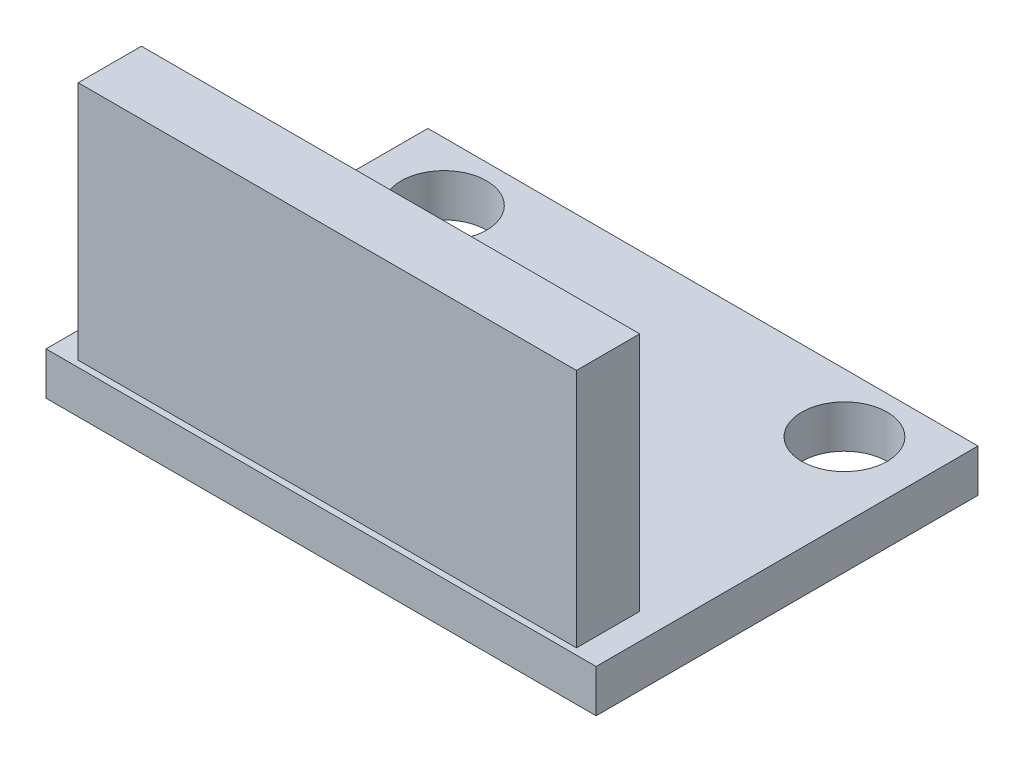
ISO-10303-21;
HEADER;
FILE_DESCRIPTION(('STEP AP214'),'2;1');
FILE_NAME('part.step','',(''),(''),'','','');
FILE_SCHEMA(('AUTOMOTIVE_DESIGN { 1 0 10303 214 1 1 1 1 }'));
ENDSEC;
DATA;
#1=APPLICATION_CONTEXT('core data for automotive mechanical design processes');
#2=APPLICATION_PROTOCOL_DEFINITION('international standard','automotive_design',2000,#1);
#3=PRODUCT_CONTEXT('',#1,'mechanical');
#4=PRODUCT('Part','Part','',(#3));
#5=PRODUCT_RELATED_PRODUCT_CATEGORY('part','',(#4));
#6=PRODUCT_DEFINITION_FORMATION('','',#4);
#7=PRODUCT_DEFINITION_CONTEXT('part definition',#1,'design');
#8=PRODUCT_DEFINITION('design','',#6,#7);
#9=PRODUCT_DEFINITION_SHAPE('','',#8);
#10=(LENGTH_UNIT() NAMED_UNIT(*) SI_UNIT(.MILLI.,.METRE.));
#11=(NAMED_UNIT(*) PLANE_ANGLE_UNIT() SI_UNIT($,.RADIAN.));
#12=(NAMED_UNIT(*) SI_UNIT($,.STERADIAN.) SOLID_ANGLE_UNIT());
#13=UNCERTAINTY_MEASURE_WITH_UNIT(LENGTH_MEASURE(1.E-05),#10,'distance_accuracy_value','');
#14=(GEOMETRIC_REPRESENTATION_CONTEXT(3) GLOBAL_UNCERTAINTY_ASSIGNED_CONTEXT((#13)) GLOBAL_UNIT_ASSIGNED_CONTEXT((#10,
#11,#12)) REPRESENTATION_CONTEXT('',''));
#15=CARTESIAN_POINT('',(0.,0.,0.));
#16=DIRECTION('',(0.,0.,1.));
#17=DIRECTION('',(1.,0.,0.));
#18=AXIS2_PLACEMENT_3D('',#15,#16,#17);
#19=CARTESIAN_POINT('',(0.,1.6,0.));
#20=DIRECTION('',(0.,-1.,0.));
#21=DIRECTION('',(0.,0.,-1.));
#22=AXIS2_PLACEMENT_3D('',#19,#20,#21);
#23=PLANE('',#22);
#24=CARTESIAN_POINT('',(7.5,1.6,-4.95));
#25=DIRECTION('',(0.,1.,0.));
#26=DIRECTION('',(0.,0.,1.));
#27=AXIS2_PLACEMENT_3D('',#24,#25,#26);
#28=CIRCLE('',#27,1.6);
#29=CARTESIAN_POINT('',(7.5,1.6,-3.35));
#30=VERTEX_POINT('',#29);
#31=EDGE_CURVE('E128',#30,#30,#28,.T.);
#32=ORIENTED_EDGE('',*,*,#31,.F.);
#33=EDGE_LOOP('',(#32));
#34=FACE_BOUND('',#33,.T.);
#35=CARTESIAN_POINT('',(-7.5,1.6,-4.95));
#36=DIRECTION('',(0.,1.,0.));
#37=DIRECTION('',(0.,0.,1.));
#38=AXIS2_PLACEMENT_3D('',#35,#36,#37);
#39=CIRCLE('',#38,1.6);
#40=CARTESIAN_POINT('',(-7.5,1.6,-3.35));
#41=VERTEX_POINT('',#40);
#42=EDGE_CURVE('E138',#41,#41,#39,.T.);
#43=ORIENTED_EDGE('',*,*,#42,.F.);
#44=EDGE_LOOP('',(#43));
#45=FACE_BOUND('',#44,.T.);
#46=DIRECTION('',(0.,0.,-1.));
#47=VECTOR('',#46,1.);
#48=CARTESIAN_POINT('',(10.3,1.6,7.15));
#49=LINE('',#48,#47);
#50=CARTESIAN_POINT('',(10.3,1.6,7.15));
#51=VERTEX_POINT('',#50);
#52=CARTESIAN_POINT('',(10.3,1.6,-7.15));
#53=VERTEX_POINT('',#52);
#54=EDGE_CURVE('E144',#51,#53,#49,.T.);
#55=ORIENTED_EDGE('',*,*,#54,.T.);
#56=DIRECTION('',(-1.,0.,0.));
#57=VECTOR('',#56,1.);
#58=CARTESIAN_POINT('',(-10.3,1.6,-7.15));
#59=LINE('',#58,#57);
#60=CARTESIAN_POINT('',(-10.3,1.6,-7.15));
#61=VERTEX_POINT('',#60);
#62=EDGE_CURVE('E147',#53,#61,#59,.T.);
#63=ORIENTED_EDGE('',*,*,#62,.T.);
#64=DIRECTION('',(0.,0.,1.));
#65=VECTOR('',#64,1.);
#66=CARTESIAN_POINT('',(-10.3,1.6,7.15));
#67=LINE('',#66,#65);
#68=CARTESIAN_POINT('',(-10.3,1.6,7.15));
#69=VERTEX_POINT('',#68);
#70=EDGE_CURVE('E150',#61,#69,#67,.T.);
#71=ORIENTED_EDGE('',*,*,#70,.T.);
#72=DIRECTION('',(1.,0.,0.));
#73=VECTOR('',#72,1.);
#74=CARTESIAN_POINT('',(-10.3,1.6,7.15));
#75=LINE('',#74,#73);
#76=EDGE_CURVE('E152',#69,#51,#75,.T.);
#77=ORIENTED_EDGE('',*,*,#76,.T.);
#78=EDGE_LOOP('',(#55,#63,#71,#77));
#79=FACE_BOUND('',#78,.T.);
#80=DIRECTION('',(0.,0.,-1.));
#81=VECTOR('',#80,1.);
#82=CARTESIAN_POINT('',(9.3290383479192,1.6,4.54720791329714));
#83=LINE('',#82,#81);
#84=CARTESIAN_POINT('',(9.3290383479192,1.6,6.91577812857723));
#85=VERTEX_POINT('',#84);
#86=CARTESIAN_POINT('',(9.3290383479192,1.6,4.54720791329714));
#87=VERTEX_POINT('',#86);
#88=EDGE_CURVE('E124',#85,#87,#83,.T.);
#89=ORIENTED_EDGE('',*,*,#88,.F.);
#90=DIRECTION('',(1.,0.,0.));
#91=VECTOR('',#90,1.);
#92=CARTESIAN_POINT('',(-9.3290383479192,1.6,6.91577812857723));
#93=LINE('',#92,#91);
#94=CARTESIAN_POINT('',(-9.3290383479192,1.6,6.91577812857723));
#95=VERTEX_POINT('',#94);
#96=EDGE_CURVE('E121',#95,#85,#93,.T.);
#97=ORIENTED_EDGE('',*,*,#96,.F.);
#98=DIRECTION('',(0.,0.,1.));
#99=VECTOR('',#98,1.);
#100=CARTESIAN_POINT('',(-9.3290383479192,1.6,4.54720791329714));
#101=LINE('',#100,#99);
#102=CARTESIAN_POINT('',(-9.3290383479192,1.6,4.54720791329714));
#103=VERTEX_POINT('',#102);
#104=EDGE_CURVE('E56',#103,#95,#101,.T.);
#105=ORIENTED_EDGE('',*,*,#104,.F.);
#106=DIRECTION('',(-1.,0.,0.));
#107=VECTOR('',#106,1.);
#108=CARTESIAN_POINT('',(-9.3290383479192,1.6,4.54720791329714));
#109=LINE('',#108,#107);
#110=EDGE_CURVE('E51',#87,#103,#109,.T.);
#111=ORIENTED_EDGE('',*,*,#110,.F.);
#112=EDGE_LOOP('',(#89,#97,#105,#111));
#113=FACE_BOUND('',#112,.T.);
#114=ADVANCED_FACE('F36',(#34,#45,#79,#113),#23,.F.);
#115=CARTESIAN_POINT('',(0.,0.,0.));
#116=DIRECTION('',(0.,-1.,0.));
#117=DIRECTION('',(0.,0.,-1.));
#118=AXIS2_PLACEMENT_3D('',#115,#116,#117);
#119=PLANE('',#118);
#120=CARTESIAN_POINT('',(-7.5,0.,-4.95));
#121=DIRECTION('',(0.,1.,0.));
#122=DIRECTION('',(0.,0.,1.));
#123=AXIS2_PLACEMENT_3D('',#120,#121,#122);
#124=CIRCLE('',#123,1.6);
#125=CARTESIAN_POINT('',(-7.5,0.,-3.35));
#126=VERTEX_POINT('',#125);
#127=EDGE_CURVE('E136',#126,#126,#124,.T.);
#128=ORIENTED_EDGE('',*,*,#127,.T.);
#129=EDGE_LOOP('',(#128));
#130=FACE_BOUND('',#129,.T.);
#131=DIRECTION('',(0.,0.,-1.));
#132=VECTOR('',#131,1.);
#133=CARTESIAN_POINT('',(10.3,0.,7.15));
#134=LINE('',#133,#132);
#135=CARTESIAN_POINT('',(10.3,0.,7.15));
#136=VERTEX_POINT('',#135);
#137=CARTESIAN_POINT('',(10.3,0.,-7.15));
#138=VERTEX_POINT('',#137);
#139=EDGE_CURVE('E141',#136,#138,#134,.T.);
#140=ORIENTED_EDGE('',*,*,#139,.F.);
#141=DIRECTION('',(1.,0.,0.));
#142=VECTOR('',#141,1.);
#143=CARTESIAN_POINT('',(-10.3,0.,7.15));
#144=LINE('',#143,#142);
#145=CARTESIAN_POINT('',(-10.3,0.,7.15));
#146=VERTEX_POINT('',#145);
#147=EDGE_CURVE('E148',#146,#136,#144,.T.);
#148=ORIENTED_EDGE('',*,*,#147,.F.);
#149=DIRECTION('',(0.,0.,1.));
#150=VECTOR('',#149,1.);
#151=CARTESIAN_POINT('',(-10.3,0.,7.15));
#152=LINE('',#151,#150);
#153=CARTESIAN_POINT('',(-10.3,0.,-7.15));
#154=VERTEX_POINT('',#153);
#155=EDGE_CURVE('E159',#154,#146,#152,.T.);
#156=ORIENTED_EDGE('',*,*,#155,.F.);
#157=DIRECTION('',(-1.,0.,0.));
#158=VECTOR('',#157,1.);
#159=CARTESIAN_POINT('',(-10.3,0.,-7.15));
#160=LINE('',#159,#158);
#161=EDGE_CURVE('E157',#138,#154,#160,.T.);
#162=ORIENTED_EDGE('',*,*,#161,.F.);
#163=EDGE_LOOP('',(#140,#148,#156,#162));
#164=FACE_BOUND('',#163,.T.);
#165=CARTESIAN_POINT('',(7.5,0.,-4.95));
#166=DIRECTION('',(0.,1.,0.));
#167=DIRECTION('',(0.,0.,1.));
#168=AXIS2_PLACEMENT_3D('',#165,#166,#167);
#169=CIRCLE('',#168,1.6);
#170=CARTESIAN_POINT('',(7.5,0.,-3.35));
#171=VERTEX_POINT('',#170);
#172=EDGE_CURVE('E125',#171,#171,#169,.T.);
#173=ORIENTED_EDGE('',*,*,#172,.T.);
#174=EDGE_LOOP('',(#173));
#175=FACE_BOUND('',#174,.T.);
#176=ADVANCED_FACE('F177',(#130,#164,#175),#119,.T.);
#177=CARTESIAN_POINT('',(10.3,1.6,7.15));
#178=DIRECTION('',(-1.,0.,0.));
#179=DIRECTION('',(0.,0.,1.));
#180=AXIS2_PLACEMENT_3D('',#177,#178,#179);
#181=PLANE('',#180);
#182=ORIENTED_EDGE('',*,*,#139,.T.);
#183=DIRECTION('',(0.,-1.,0.));
#184=VECTOR('',#183,1.);
#185=CARTESIAN_POINT('',(10.3,1.6,-7.15));
#186=LINE('',#185,#184);
#187=EDGE_CURVE('E11',#53,#138,#186,.T.);
#188=ORIENTED_EDGE('',*,*,#187,.F.);
#189=ORIENTED_EDGE('',*,*,#54,.F.);
#190=DIRECTION('',(0.,-1.,0.));
#191=VECTOR('',#190,1.);
#192=CARTESIAN_POINT('',(10.3,1.6,7.15));
#193=LINE('',#192,#191);
#194=EDGE_CURVE('E154',#51,#136,#193,.T.);
#195=ORIENTED_EDGE('',*,*,#194,.T.);
#196=EDGE_LOOP('',(#182,#188,#189,#195));
#197=FACE_BOUND('',#196,.T.);
#198=ADVANCED_FACE('F38',(#197),#181,.F.);
#199=CARTESIAN_POINT('',(-10.3,1.6,-7.15));
#200=DIRECTION('',(0.,0.,1.));
#201=DIRECTION('',(1.,0.,0.));
#202=AXIS2_PLACEMENT_3D('',#199,#200,#201);
#203=PLANE('',#202);
#204=ORIENTED_EDGE('',*,*,#161,.T.);
#205=DIRECTION('',(0.,-1.,0.));
#206=VECTOR('',#205,1.);
#207=CARTESIAN_POINT('',(-10.3,1.6,-7.15));
#208=LINE('',#207,#206);
#209=EDGE_CURVE('E44',#61,#154,#208,.T.);
#210=ORIENTED_EDGE('',*,*,#209,.F.);
#211=ORIENTED_EDGE('',*,*,#62,.F.);
#212=ORIENTED_EDGE('',*,*,#187,.T.);
#213=EDGE_LOOP('',(#204,#210,#211,#212));
#214=FACE_BOUND('',#213,.T.);
#215=ADVANCED_FACE('F187',(#214),#203,.F.);
#216=CARTESIAN_POINT('',(-10.3,1.6,7.15));
#217=DIRECTION('',(1.,0.,0.));
#218=DIRECTION('',(0.,0.,-1.));
#219=AXIS2_PLACEMENT_3D('',#216,#217,#218);
#220=PLANE('',#219);
#221=ORIENTED_EDGE('',*,*,#155,.T.);
#222=DIRECTION('',(0.,-1.,0.));
#223=VECTOR('',#222,1.);
#224=CARTESIAN_POINT('',(-10.3,1.6,7.15));
#225=LINE('',#224,#223);
#226=EDGE_CURVE('E164',#69,#146,#225,.T.);
#227=ORIENTED_EDGE('',*,*,#226,.F.);
#228=ORIENTED_EDGE('',*,*,#70,.F.);
#229=ORIENTED_EDGE('',*,*,#209,.T.);
#230=EDGE_LOOP('',(#221,#227,#228,#229));
#231=FACE_BOUND('',#230,.T.);
#232=ADVANCED_FACE('F171',(#231),#220,.F.);
#233=CARTESIAN_POINT('',(-10.3,1.6,7.15));
#234=DIRECTION('',(0.,0.,-1.));
#235=DIRECTION('',(-1.,0.,0.));
#236=AXIS2_PLACEMENT_3D('',#233,#234,#235);
#237=PLANE('',#236);
#238=ORIENTED_EDGE('',*,*,#147,.T.);
#239=ORIENTED_EDGE('',*,*,#194,.F.);
#240=ORIENTED_EDGE('',*,*,#76,.F.);
#241=ORIENTED_EDGE('',*,*,#226,.T.);
#242=EDGE_LOOP('',(#238,#239,#240,#241));
#243=FACE_BOUND('',#242,.T.);
#244=ADVANCED_FACE('F181',(#243),#237,.F.);
#245=CARTESIAN_POINT('',(-7.5,1.6,-4.95));
#246=DIRECTION('',(0.,-1.,0.));
#247=DIRECTION('',(0.,0.,-1.));
#248=AXIS2_PLACEMENT_3D('',#245,#246,#247);
#249=CYLINDRICAL_SURFACE('',#248,1.6);
#250=ORIENTED_EDGE('',*,*,#42,.T.);
#251=EDGE_LOOP('',(#250));
#252=FACE_BOUND('',#251,.T.);
#253=ORIENTED_EDGE('',*,*,#127,.F.);
#254=EDGE_LOOP('',(#253));
#255=FACE_BOUND('',#254,.T.);
#256=ADVANCED_FACE('F205',(#252,#255),#249,.F.);
#257=CARTESIAN_POINT('',(7.5,1.6,-4.95));
#258=DIRECTION('',(0.,-1.,0.));
#259=DIRECTION('',(0.,0.,-1.));
#260=AXIS2_PLACEMENT_3D('',#257,#258,#259);
#261=CYLINDRICAL_SURFACE('',#260,1.6);
#262=ORIENTED_EDGE('',*,*,#31,.T.);
#263=EDGE_LOOP('',(#262));
#264=FACE_BOUND('',#263,.T.);
#265=ORIENTED_EDGE('',*,*,#172,.F.);
#266=EDGE_LOOP('',(#265));
#267=FACE_BOUND('',#266,.T.);
#268=ADVANCED_FACE('F212',(#264,#267),#261,.F.);
#269=CARTESIAN_POINT('',(9.3290383479192,10.6,4.54720791329714));
#270=DIRECTION('',(-1.,0.,0.));
#271=DIRECTION('',(0.,0.,1.));
#272=AXIS2_PLACEMENT_3D('',#269,#270,#271);
#273=PLANE('',#272);
#274=ORIENTED_EDGE('',*,*,#88,.T.);
#275=DIRECTION('',(0.,-1.,0.));
#276=VECTOR('',#275,1.);
#277=CARTESIAN_POINT('',(9.3290383479192,10.6,4.54720791329714));
#278=LINE('',#277,#276);
#279=CARTESIAN_POINT('',(9.3290383479192,10.6,4.54720791329714));
#280=VERTEX_POINT('',#279);
#281=EDGE_CURVE('E104',#280,#87,#278,.T.);
#282=ORIENTED_EDGE('',*,*,#281,.F.);
#283=DIRECTION('',(0.,0.,-1.));
#284=VECTOR('',#283,1.);
#285=CARTESIAN_POINT('',(9.3290383479192,10.6,4.54720791329714));
#286=LINE('',#285,#284);
#287=CARTESIAN_POINT('',(9.3290383479192,10.6,6.91577812857723));
#288=VERTEX_POINT('',#287);
#289=EDGE_CURVE('E112',#288,#280,#286,.T.);
#290=ORIENTED_EDGE('',*,*,#289,.F.);
#291=DIRECTION('',(0.,-1.,0.));
#292=VECTOR('',#291,1.);
#293=CARTESIAN_POINT('',(9.3290383479192,10.6,6.91577812857723));
#294=LINE('',#293,#292);
#295=EDGE_CURVE('E308',#288,#85,#294,.T.);
#296=ORIENTED_EDGE('',*,*,#295,.T.);
#297=EDGE_LOOP('',(#274,#282,#290,#296));
#298=FACE_BOUND('',#297,.T.);
#299=ADVANCED_FACE('F123',(#298),#273,.F.);
#300=CARTESIAN_POINT('',(-9.3290383479192,10.6,4.54720791329714));
#301=DIRECTION('',(0.,0.,1.));
#302=DIRECTION('',(1.,0.,0.));
#303=AXIS2_PLACEMENT_3D('',#300,#301,#302);
#304=PLANE('',#303);
#305=ORIENTED_EDGE('',*,*,#110,.T.);
#306=DIRECTION('',(0.,-1.,0.));
#307=VECTOR('',#306,1.);
#308=CARTESIAN_POINT('',(-9.3290383479192,10.6,4.54720791329714));
#309=LINE('',#308,#307);
#310=CARTESIAN_POINT('',(-9.3290383479192,10.6,4.54720791329714));
#311=VERTEX_POINT('',#310);
#312=EDGE_CURVE('E107',#311,#103,#309,.T.);
#313=ORIENTED_EDGE('',*,*,#312,.F.);
#314=DIRECTION('',(-1.,0.,0.));
#315=VECTOR('',#314,1.);
#316=CARTESIAN_POINT('',(-9.3290383479192,10.6,4.54720791329714));
#317=LINE('',#316,#315);
#318=EDGE_CURVE('E100',#280,#311,#317,.T.);
#319=ORIENTED_EDGE('',*,*,#318,.F.);
#320=ORIENTED_EDGE('',*,*,#281,.T.);
#321=EDGE_LOOP('',(#305,#313,#319,#320));
#322=FACE_BOUND('',#321,.T.);
#323=ADVANCED_FACE('F102',(#322),#304,.F.);
#324=CARTESIAN_POINT('',(-9.3290383479192,10.6,4.54720791329714));
#325=DIRECTION('',(1.,0.,0.));
#326=DIRECTION('',(0.,0.,-1.));
#327=AXIS2_PLACEMENT_3D('',#324,#325,#326);
#328=PLANE('',#327);
#329=ORIENTED_EDGE('',*,*,#104,.T.);
#330=DIRECTION('',(0.,-1.,0.));
#331=VECTOR('',#330,1.);
#332=CARTESIAN_POINT('',(-9.3290383479192,10.6,6.91577812857723));
#333=LINE('',#332,#331);
#334=CARTESIAN_POINT('',(-9.3290383479192,10.6,6.91577812857723));
#335=VERTEX_POINT('',#334);
#336=EDGE_CURVE('E131',#335,#95,#333,.T.);
#337=ORIENTED_EDGE('',*,*,#336,.F.);
#338=DIRECTION('',(0.,0.,1.));
#339=VECTOR('',#338,1.);
#340=CARTESIAN_POINT('',(-9.3290383479192,10.6,4.54720791329714));
#341=LINE('',#340,#339);
#342=EDGE_CURVE('E111',#311,#335,#341,.T.);
#343=ORIENTED_EDGE('',*,*,#342,.F.);
#344=ORIENTED_EDGE('',*,*,#312,.T.);
#345=EDGE_LOOP('',(#329,#337,#343,#344));
#346=FACE_BOUND('',#345,.T.);
#347=ADVANCED_FACE('F229',(#346),#328,.F.);
#348=CARTESIAN_POINT('',(-9.3290383479192,10.6,6.91577812857723));
#349=DIRECTION('',(0.,0.,-1.));
#350=DIRECTION('',(-1.,0.,0.));
#351=AXIS2_PLACEMENT_3D('',#348,#349,#350);
#352=PLANE('',#351);
#353=ORIENTED_EDGE('',*,*,#96,.T.);
#354=ORIENTED_EDGE('',*,*,#295,.F.);
#355=DIRECTION('',(1.,0.,0.));
#356=VECTOR('',#355,1.);
#357=CARTESIAN_POINT('',(-9.3290383479192,10.6,6.91577812857723));
#358=LINE('',#357,#356);
#359=EDGE_CURVE('E117',#335,#288,#358,.T.);
#360=ORIENTED_EDGE('',*,*,#359,.F.);
#361=ORIENTED_EDGE('',*,*,#336,.T.);
#362=EDGE_LOOP('',(#353,#354,#360,#361));
#363=FACE_BOUND('',#362,.T.);
#364=ADVANCED_FACE('F232',(#363),#352,.F.);
#365=CARTESIAN_POINT('',(0.,10.6,0.));
#366=DIRECTION('',(0.,1.,0.));
#367=DIRECTION('',(0.,0.,1.));
#368=AXIS2_PLACEMENT_3D('',#365,#366,#367);
#369=PLANE('',#368);
#370=ORIENTED_EDGE('',*,*,#289,.T.);
#371=ORIENTED_EDGE('',*,*,#318,.T.);
#372=ORIENTED_EDGE('',*,*,#342,.T.);
#373=ORIENTED_EDGE('',*,*,#359,.T.);
#374=EDGE_LOOP('',(#370,#371,#372,#373));
#375=FACE_BOUND('',#374,.T.);
#376=ADVANCED_FACE('F115',(#375),#369,.T.);
#377=CLOSED_SHELL('',(#114,#176,#198,#215,#232,#244,#256,#268,#299,#323,#347,#364,#376));
#378=MANIFOLD_SOLID_BREP('B2',#377);
#379=ADVANCED_BREP_SHAPE_REPRESENTATION('',(#18,#378),#14);
#380=SHAPE_DEFINITION_REPRESENTATION(#9,#379);
ENDSEC;
END-ISO-10303-21;
